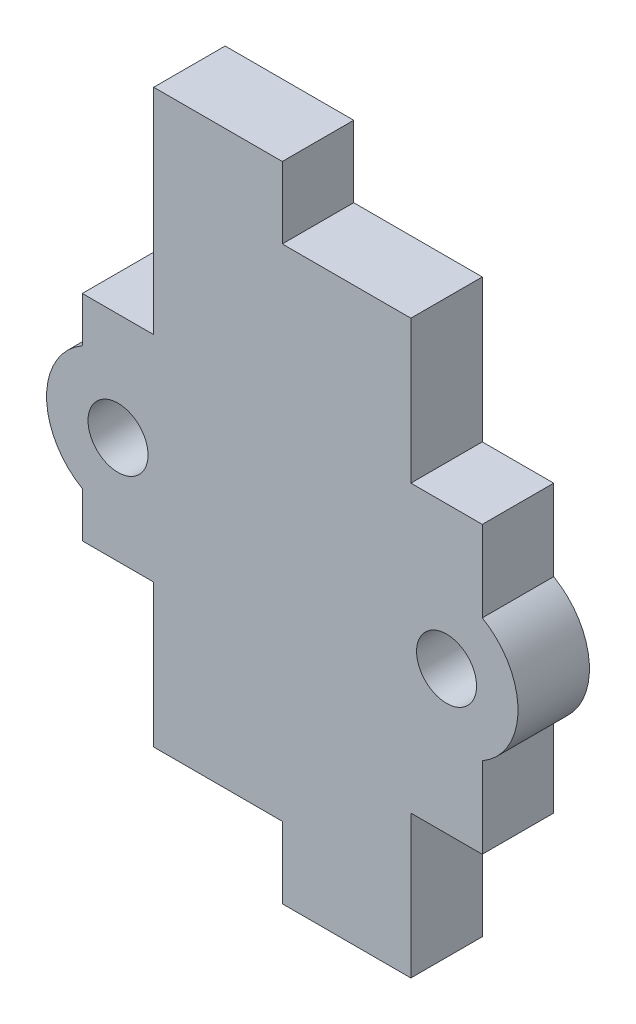
ISO-10303-21;
HEADER;
FILE_DESCRIPTION(('STEP AP214'),'2;1');
FILE_NAME('part.step','',(''),(''),'','','');
FILE_SCHEMA(('AUTOMOTIVE_DESIGN { 1 0 10303 214 1 1 1 1 }'));
ENDSEC;
DATA;
#1=APPLICATION_CONTEXT('core data for automotive mechanical design processes');
#2=APPLICATION_PROTOCOL_DEFINITION('international standard','automotive_design',2000,#1);
#3=PRODUCT_CONTEXT('',#1,'mechanical');
#4=PRODUCT('Part','Part','',(#3));
#5=PRODUCT_RELATED_PRODUCT_CATEGORY('part','',(#4));
#6=PRODUCT_DEFINITION_FORMATION('','',#4);
#7=PRODUCT_DEFINITION_CONTEXT('part definition',#1,'design');
#8=PRODUCT_DEFINITION('design','',#6,#7);
#9=PRODUCT_DEFINITION_SHAPE('','',#8);
#10=(LENGTH_UNIT() NAMED_UNIT(*) SI_UNIT(.MILLI.,.METRE.));
#11=(NAMED_UNIT(*) PLANE_ANGLE_UNIT() SI_UNIT($,.RADIAN.));
#12=(NAMED_UNIT(*) SI_UNIT($,.STERADIAN.) SOLID_ANGLE_UNIT());
#13=UNCERTAINTY_MEASURE_WITH_UNIT(LENGTH_MEASURE(1.E-05),#10,'distance_accuracy_value','');
#14=(GEOMETRIC_REPRESENTATION_CONTEXT(3) GLOBAL_UNCERTAINTY_ASSIGNED_CONTEXT((#13)) GLOBAL_UNIT_ASSIGNED_CONTEXT((#10,
#11,#12)) REPRESENTATION_CONTEXT('',''));
#15=CARTESIAN_POINT('',(0.,0.,0.));
#16=DIRECTION('',(0.,0.,1.));
#17=DIRECTION('',(1.,0.,0.));
#18=AXIS2_PLACEMENT_3D('',#15,#16,#17);
#19=CARTESIAN_POINT('',(-23.,10.,0.));
#20=DIRECTION('',(-1.,0.,0.));
#21=DIRECTION('',(0.,0.,1.));
#22=AXIS2_PLACEMENT_3D('',#19,#20,#21);
#23=PLANE('',#22);
#24=DIRECTION('',(0.,-1.,0.));
#25=VECTOR('',#24,1.);
#26=CARTESIAN_POINT('',(-23.,10.,5.));
#27=LINE('',#26,#25);
#28=CARTESIAN_POINT('',(-23.,13.1698729810778,5.));
#29=VERTEX_POINT('',#28);
#30=CARTESIAN_POINT('',(-23.,10.,5.));
#31=VERTEX_POINT('',#30);
#32=EDGE_CURVE('E188',#29,#31,#27,.T.);
#33=ORIENTED_EDGE('',*,*,#32,.F.);
#34=DIRECTION('',(0.,0.,1.));
#35=VECTOR('',#34,1.);
#36=CARTESIAN_POINT('',(-23.,13.1698729810778,0.));
#37=LINE('',#36,#35);
#38=CARTESIAN_POINT('',(-23.,13.1698729810778,0.));
#39=VERTEX_POINT('',#38);
#40=EDGE_CURVE('E175',#39,#29,#37,.T.);
#41=ORIENTED_EDGE('',*,*,#40,.F.);
#42=DIRECTION('',(0.,-1.,0.));
#43=VECTOR('',#42,1.);
#44=CARTESIAN_POINT('',(-23.,10.,0.));
#45=LINE('',#44,#43);
#46=CARTESIAN_POINT('',(-23.,10.,0.));
#47=VERTEX_POINT('',#46);
#48=EDGE_CURVE('E186',#39,#47,#45,.T.);
#49=ORIENTED_EDGE('',*,*,#48,.T.);
#50=DIRECTION('',(0.,0.,1.));
#51=VECTOR('',#50,1.);
#52=CARTESIAN_POINT('',(-23.,10.,0.));
#53=LINE('',#52,#51);
#54=EDGE_CURVE('E215',#47,#31,#53,.T.);
#55=ORIENTED_EDGE('',*,*,#54,.T.);
#56=EDGE_LOOP('',(#33,#41,#49,#55));
#57=FACE_BOUND('',#56,.T.);
#58=ADVANCED_FACE('F36',(#57),#23,.T.);
#59=CARTESIAN_POINT('',(-23.,25.,0.));
#60=VERTEX_POINT('',#59);
#61=CARTESIAN_POINT('',(-23.,21.8301270189222,0.));
#62=VERTEX_POINT('',#61);
#63=EDGE_CURVE('E194',#60,#62,#45,.T.);
#64=ORIENTED_EDGE('',*,*,#63,.T.);
#65=DIRECTION('',(0.,0.,1.));
#66=VECTOR('',#65,1.);
#67=CARTESIAN_POINT('',(-23.,21.8301270189222,0.));
#68=LINE('',#67,#66);
#69=CARTESIAN_POINT('',(-23.,21.8301270189222,5.));
#70=VERTEX_POINT('',#69);
#71=EDGE_CURVE('E178',#62,#70,#68,.T.);
#72=ORIENTED_EDGE('',*,*,#71,.T.);
#73=CARTESIAN_POINT('',(-23.,25.,5.));
#74=VERTEX_POINT('',#73);
#75=EDGE_CURVE('E208',#74,#70,#27,.T.);
#76=ORIENTED_EDGE('',*,*,#75,.F.);
#77=DIRECTION('',(0.,0.,1.));
#78=VECTOR('',#77,1.);
#79=CARTESIAN_POINT('',(-23.,25.,0.));
#80=LINE('',#79,#78);
#81=EDGE_CURVE('E217',#60,#74,#80,.T.);
#82=ORIENTED_EDGE('',*,*,#81,.F.);
#83=EDGE_LOOP('',(#64,#72,#76,#82));
#84=FACE_BOUND('',#83,.T.);
#85=ADVANCED_FACE('F327',(#84),#23,.T.);
#86=CARTESIAN_POINT('',(5.,0.,0.));
#87=DIRECTION('',(-1.,0.,0.));
#88=DIRECTION('',(0.,0.,1.));
#89=AXIS2_PLACEMENT_3D('',#86,#87,#88);
#90=PLANE('',#89);
#91=DIRECTION('',(0.,-1.,0.));
#92=VECTOR('',#91,1.);
#93=CARTESIAN_POINT('',(5.,5.0000000000001,5.));
#94=LINE('',#93,#92);
#95=CARTESIAN_POINT('',(5.,25.0000000000001,5.));
#96=VERTEX_POINT('',#95);
#97=CARTESIAN_POINT('',(5.,19.3301270189223,5.));
#98=VERTEX_POINT('',#97);
#99=EDGE_CURVE('E240',#96,#98,#94,.T.);
#100=ORIENTED_EDGE('',*,*,#99,.T.);
#101=DIRECTION('',(0.,0.,-1.));
#102=VECTOR('',#101,1.);
#103=CARTESIAN_POINT('',(5.,19.3301270189223,5.));
#104=LINE('',#103,#102);
#105=CARTESIAN_POINT('',(5.,19.3301270189223,0.));
#106=VERTEX_POINT('',#105);
#107=EDGE_CURVE('E397',#98,#106,#104,.T.);
#108=ORIENTED_EDGE('',*,*,#107,.T.);
#109=DIRECTION('',(0.,1.,0.));
#110=VECTOR('',#109,1.);
#111=CARTESIAN_POINT('',(5.,5.0000000000001,0.));
#112=LINE('',#111,#110);
#113=CARTESIAN_POINT('',(5.,25.0000000000001,0.));
#114=VERTEX_POINT('',#113);
#115=EDGE_CURVE('E245',#106,#114,#112,.T.);
#116=ORIENTED_EDGE('',*,*,#115,.T.);
#117=DIRECTION('',(0.,0.,1.));
#118=VECTOR('',#117,1.);
#119=CARTESIAN_POINT('',(5.,25.0000000000001,5.));
#120=LINE('',#119,#118);
#121=EDGE_CURVE('E247',#114,#96,#120,.T.);
#122=ORIENTED_EDGE('',*,*,#121,.T.);
#123=EDGE_LOOP('',(#100,#108,#116,#122));
#124=FACE_BOUND('',#123,.T.);
#125=ADVANCED_FACE('F331',(#124),#90,.F.);
#126=CARTESIAN_POINT('',(0.,35.,5.));
#127=DIRECTION('',(0.,-1.,0.));
#128=DIRECTION('',(0.,0.,-1.));
#129=AXIS2_PLACEMENT_3D('',#126,#127,#128);
#130=PLANE('',#129);
#131=DIRECTION('',(0.,0.,-1.));
#132=VECTOR('',#131,1.);
#133=CARTESIAN_POINT('',(-9.,35.,0.));
#134=LINE('',#133,#132);
#135=CARTESIAN_POINT('',(-9.,35.,5.));
#136=VERTEX_POINT('',#135);
#137=CARTESIAN_POINT('',(-9.,35.,0.));
#138=VERTEX_POINT('',#137);
#139=EDGE_CURVE('E369',#136,#138,#134,.T.);
#140=ORIENTED_EDGE('',*,*,#139,.F.);
#141=DIRECTION('',(-1.,0.,0.));
#142=VECTOR('',#141,1.);
#143=CARTESIAN_POINT('',(0.,35.,5.));
#144=LINE('',#143,#142);
#145=CARTESIAN_POINT('',(0.,35.,5.));
#146=VERTEX_POINT('',#145);
#147=EDGE_CURVE('E270',#146,#136,#144,.T.);
#148=ORIENTED_EDGE('',*,*,#147,.F.);
#149=DIRECTION('',(0.,0.,-1.));
#150=VECTOR('',#149,1.);
#151=CARTESIAN_POINT('',(0.,35.,5.));
#152=LINE('',#151,#150);
#153=CARTESIAN_POINT('',(0.,35.,0.));
#154=VERTEX_POINT('',#153);
#155=EDGE_CURVE('E11',#146,#154,#152,.T.);
#156=ORIENTED_EDGE('',*,*,#155,.T.);
#157=DIRECTION('',(-1.,0.,0.));
#158=VECTOR('',#157,1.);
#159=CARTESIAN_POINT('',(0.,35.,0.));
#160=LINE('',#159,#158);
#161=EDGE_CURVE('E283',#154,#138,#160,.T.);
#162=ORIENTED_EDGE('',*,*,#161,.T.);
#163=EDGE_LOOP('',(#140,#148,#156,#162));
#164=FACE_BOUND('',#163,.T.);
#165=ADVANCED_FACE('F359',(#164),#130,.F.);
#166=CARTESIAN_POINT('',(-18.,0.,5.));
#167=DIRECTION('',(1.,0.,0.));
#168=DIRECTION('',(0.,0.,-1.));
#169=AXIS2_PLACEMENT_3D('',#166,#167,#168);
#170=PLANE('',#169);
#171=DIRECTION('',(0.,0.,1.));
#172=VECTOR('',#171,1.);
#173=CARTESIAN_POINT('',(-18.,10.,0.));
#174=LINE('',#173,#172);
#175=CARTESIAN_POINT('',(-18.,10.,0.));
#176=VERTEX_POINT('',#175);
#177=CARTESIAN_POINT('',(-18.,10.,5.));
#178=VERTEX_POINT('',#177);
#179=EDGE_CURVE('E212',#176,#178,#174,.T.);
#180=ORIENTED_EDGE('',*,*,#179,.F.);
#181=DIRECTION('',(0.,-1.,0.));
#182=VECTOR('',#181,1.);
#183=CARTESIAN_POINT('',(-18.,0.,0.));
#184=LINE('',#183,#182);
#185=CARTESIAN_POINT('',(-18.,0.,0.));
#186=VERTEX_POINT('',#185);
#187=EDGE_CURVE('E285',#176,#186,#184,.T.);
#188=ORIENTED_EDGE('',*,*,#187,.T.);
#189=DIRECTION('',(0.,0.,-1.));
#190=VECTOR('',#189,1.);
#191=CARTESIAN_POINT('',(-18.,0.,5.));
#192=LINE('',#191,#190);
#193=CARTESIAN_POINT('',(-18.,0.,5.));
#194=VERTEX_POINT('',#193);
#195=EDGE_CURVE('E44',#194,#186,#192,.T.);
#196=ORIENTED_EDGE('',*,*,#195,.F.);
#197=DIRECTION('',(0.,-1.,0.));
#198=VECTOR('',#197,1.);
#199=CARTESIAN_POINT('',(-18.,0.,5.));
#200=LINE('',#199,#198);
#201=EDGE_CURVE('E274',#178,#194,#200,.T.);
#202=ORIENTED_EDGE('',*,*,#201,.F.);
#203=EDGE_LOOP('',(#180,#188,#196,#202));
#204=FACE_BOUND('',#203,.T.);
#205=ADVANCED_FACE('F308',(#204),#170,.F.);
#206=CARTESIAN_POINT('',(0.,0.,5.));
#207=DIRECTION('',(0.,1.,0.));
#208=DIRECTION('',(0.,0.,1.));
#209=AXIS2_PLACEMENT_3D('',#206,#207,#208);
#210=PLANE('',#209);
#211=DIRECTION('',(0.,0.,-1.));
#212=VECTOR('',#211,1.);
#213=CARTESIAN_POINT('',(-9.,0.,5.));
#214=LINE('',#213,#212);
#215=CARTESIAN_POINT('',(-9.,0.,5.));
#216=VERTEX_POINT('',#215);
#217=CARTESIAN_POINT('',(-9.,0.,0.));
#218=VERTEX_POINT('',#217);
#219=EDGE_CURVE('E214',#216,#218,#214,.T.);
#220=ORIENTED_EDGE('',*,*,#219,.F.);
#221=DIRECTION('',(1.,0.,0.));
#222=VECTOR('',#221,1.);
#223=CARTESIAN_POINT('',(0.,0.,5.));
#224=LINE('',#223,#222);
#225=EDGE_CURVE('E278',#194,#216,#224,.T.);
#226=ORIENTED_EDGE('',*,*,#225,.F.);
#227=ORIENTED_EDGE('',*,*,#195,.T.);
#228=DIRECTION('',(1.,0.,0.));
#229=VECTOR('',#228,1.);
#230=CARTESIAN_POINT('',(0.,0.,0.));
#231=LINE('',#230,#229);
#232=EDGE_CURVE('E289',#186,#218,#231,.T.);
#233=ORIENTED_EDGE('',*,*,#232,.T.);
#234=EDGE_LOOP('',(#220,#226,#227,#233));
#235=FACE_BOUND('',#234,.T.);
#236=ADVANCED_FACE('F295',(#235),#210,.F.);
#237=CARTESIAN_POINT('',(0.,0.,5.));
#238=DIRECTION('',(-1.,0.,0.));
#239=DIRECTION('',(0.,0.,1.));
#240=AXIS2_PLACEMENT_3D('',#237,#238,#239);
#241=PLANE('',#240);
#242=DIRECTION('',(0.,0.,1.));
#243=VECTOR('',#242,1.);
#244=CARTESIAN_POINT('',(0.,25.0000000000001,5.));
#245=LINE('',#244,#243);
#246=CARTESIAN_POINT('',(0.,25.0000000000001,0.));
#247=VERTEX_POINT('',#246);
#248=CARTESIAN_POINT('',(0.,25.0000000000001,5.));
#249=VERTEX_POINT('',#248);
#250=EDGE_CURVE('E252',#247,#249,#245,.T.);
#251=ORIENTED_EDGE('',*,*,#250,.F.);
#252=DIRECTION('',(0.,1.,0.));
#253=VECTOR('',#252,1.);
#254=CARTESIAN_POINT('',(0.,0.,0.));
#255=LINE('',#254,#253);
#256=EDGE_CURVE('E266',#247,#154,#255,.T.);
#257=ORIENTED_EDGE('',*,*,#256,.T.);
#258=ORIENTED_EDGE('',*,*,#155,.F.);
#259=DIRECTION('',(0.,1.,0.));
#260=VECTOR('',#259,1.);
#261=CARTESIAN_POINT('',(0.,0.,5.));
#262=LINE('',#261,#260);
#263=EDGE_CURVE('E271',#249,#146,#262,.T.);
#264=ORIENTED_EDGE('',*,*,#263,.F.);
#265=EDGE_LOOP('',(#251,#257,#258,#264));
#266=FACE_BOUND('',#265,.T.);
#267=ADVANCED_FACE('F38',(#266),#241,.F.);
#268=DIRECTION('',(0.,0.,-1.));
#269=VECTOR('',#268,1.);
#270=CARTESIAN_POINT('',(0.,5.0000000000001,5.));
#271=LINE('',#270,#269);
#272=CARTESIAN_POINT('',(0.,5.0000000000001,5.));
#273=VERTEX_POINT('',#272);
#274=CARTESIAN_POINT('',(0.,5.0000000000001,0.));
#275=VERTEX_POINT('',#274);
#276=EDGE_CURVE('E239',#273,#275,#271,.T.);
#277=ORIENTED_EDGE('',*,*,#276,.F.);
#278=CARTESIAN_POINT('',(0.,-5.,5.));
#279=VERTEX_POINT('',#278);
#280=EDGE_CURVE('E267',#279,#273,#262,.T.);
#281=ORIENTED_EDGE('',*,*,#280,.F.);
#282=DIRECTION('',(0.,0.,1.));
#283=VECTOR('',#282,1.);
#284=CARTESIAN_POINT('',(0.,-5.,5.));
#285=LINE('',#284,#283);
#286=CARTESIAN_POINT('',(0.,-5.,0.));
#287=VERTEX_POINT('',#286);
#288=EDGE_CURVE('E221',#287,#279,#285,.T.);
#289=ORIENTED_EDGE('',*,*,#288,.F.);
#290=EDGE_CURVE('E281',#287,#275,#255,.T.);
#291=ORIENTED_EDGE('',*,*,#290,.T.);
#292=EDGE_LOOP('',(#277,#281,#289,#291));
#293=FACE_BOUND('',#292,.T.);
#294=ADVANCED_FACE('F357',(#293),#241,.F.);
#295=CARTESIAN_POINT('',(-18.,40.,0.));
#296=VERTEX_POINT('',#295);
#297=CARTESIAN_POINT('',(-18.,25.,0.));
#298=VERTEX_POINT('',#297);
#299=EDGE_CURVE('E286',#296,#298,#184,.T.);
#300=ORIENTED_EDGE('',*,*,#299,.T.);
#301=DIRECTION('',(0.,0.,1.));
#302=VECTOR('',#301,1.);
#303=CARTESIAN_POINT('',(-18.,25.,0.));
#304=LINE('',#303,#302);
#305=CARTESIAN_POINT('',(-18.,25.,5.));
#306=VERTEX_POINT('',#305);
#307=EDGE_CURVE('E203',#298,#306,#304,.T.);
#308=ORIENTED_EDGE('',*,*,#307,.T.);
#309=CARTESIAN_POINT('',(-18.,40.,5.));
#310=VERTEX_POINT('',#309);
#311=EDGE_CURVE('E275',#310,#306,#200,.T.);
#312=ORIENTED_EDGE('',*,*,#311,.F.);
#313=DIRECTION('',(0.,0.,1.));
#314=VECTOR('',#313,1.);
#315=CARTESIAN_POINT('',(-18.,40.,0.));
#316=LINE('',#315,#314);
#317=EDGE_CURVE('E376',#296,#310,#316,.T.);
#318=ORIENTED_EDGE('',*,*,#317,.F.);
#319=EDGE_LOOP('',(#300,#308,#312,#318));
#320=FACE_BOUND('',#319,.T.);
#321=ADVANCED_FACE('F349',(#320),#170,.F.);
#322=CARTESIAN_POINT('',(0.,0.,5.));
#323=DIRECTION('',(0.,0.,1.));
#324=DIRECTION('',(1.,0.,0.));
#325=AXIS2_PLACEMENT_3D('',#322,#323,#324);
#326=PLANE('',#325);
#327=CARTESIAN_POINT('',(-20.5,17.5,5.));
#328=DIRECTION('',(0.,0.,1.));
#329=DIRECTION('',(1.,0.,0.));
#330=AXIS2_PLACEMENT_3D('',#327,#328,#329);
#331=CIRCLE('',#330,2.1);
#332=CARTESIAN_POINT('',(-18.4,17.5,5.));
#333=VERTEX_POINT('',#332);
#334=EDGE_CURVE('E411',#333,#333,#331,.T.);
#335=ORIENTED_EDGE('',*,*,#334,.F.);
#336=EDGE_LOOP('',(#335));
#337=FACE_BOUND('',#336,.T.);
#338=CARTESIAN_POINT('',(2.5,15.0000000000001,5.));
#339=DIRECTION('',(0.,0.,-1.));
#340=DIRECTION('',(-1.,0.,0.));
#341=AXIS2_PLACEMENT_3D('',#338,#339,#340);
#342=CIRCLE('',#341,2.1);
#343=CARTESIAN_POINT('',(0.400000000000001,15.0000000000001,5.));
#344=VERTEX_POINT('',#343);
#345=EDGE_CURVE('E377',#344,#344,#342,.T.);
#346=ORIENTED_EDGE('',*,*,#345,.T.);
#347=EDGE_LOOP('',(#346));
#348=FACE_BOUND('',#347,.T.);
#349=ORIENTED_EDGE('',*,*,#280,.T.);
#350=DIRECTION('',(-1.,0.,0.));
#351=VECTOR('',#350,1.);
#352=CARTESIAN_POINT('',(5.,5.0000000000001,5.));
#353=LINE('',#352,#351);
#354=CARTESIAN_POINT('',(5.,5.0000000000001,5.));
#355=VERTEX_POINT('',#354);
#356=EDGE_CURVE('E263',#355,#273,#353,.T.);
#357=ORIENTED_EDGE('',*,*,#356,.F.);
#358=CARTESIAN_POINT('',(5.,10.6698729810779,5.));
#359=VERTEX_POINT('',#358);
#360=EDGE_CURVE('E243',#359,#355,#94,.T.);
#361=ORIENTED_EDGE('',*,*,#360,.F.);
#362=CARTESIAN_POINT('',(2.5,15.0000000000001,5.));
#363=DIRECTION('',(0.,0.,-1.));
#364=DIRECTION('',(1.,0.,0.));
#365=AXIS2_PLACEMENT_3D('',#362,#363,#364);
#366=CIRCLE('',#365,5.);
#367=EDGE_CURVE('E402',#98,#359,#366,.T.);
#368=ORIENTED_EDGE('',*,*,#367,.F.);
#369=ORIENTED_EDGE('',*,*,#99,.F.);
#370=DIRECTION('',(-1.,0.,0.));
#371=VECTOR('',#370,1.);
#372=CARTESIAN_POINT('',(5.,25.0000000000001,5.));
#373=LINE('',#372,#371);
#374=EDGE_CURVE('E249',#96,#249,#373,.T.);
#375=ORIENTED_EDGE('',*,*,#374,.T.);
#376=ORIENTED_EDGE('',*,*,#263,.T.);
#377=ORIENTED_EDGE('',*,*,#147,.T.);
#378=DIRECTION('',(0.,-1.,0.));
#379=VECTOR('',#378,1.);
#380=CARTESIAN_POINT('',(-9.,40.,5.));
#381=LINE('',#380,#379);
#382=CARTESIAN_POINT('',(-9.,40.,5.));
#383=VERTEX_POINT('',#382);
#384=EDGE_CURVE('E207',#383,#136,#381,.T.);
#385=ORIENTED_EDGE('',*,*,#384,.F.);
#386=DIRECTION('',(1.,0.,0.));
#387=VECTOR('',#386,1.);
#388=CARTESIAN_POINT('',(-18.,40.,5.));
#389=LINE('',#388,#387);
#390=EDGE_CURVE('E390',#310,#383,#389,.T.);
#391=ORIENTED_EDGE('',*,*,#390,.F.);
#392=ORIENTED_EDGE('',*,*,#311,.T.);
#393=DIRECTION('',(-1.,0.,0.));
#394=VECTOR('',#393,1.);
#395=CARTESIAN_POINT('',(-18.,25.,5.));
#396=LINE('',#395,#394);
#397=EDGE_CURVE('E204',#306,#74,#396,.T.);
#398=ORIENTED_EDGE('',*,*,#397,.T.);
#399=ORIENTED_EDGE('',*,*,#75,.T.);
#400=CARTESIAN_POINT('',(-20.5,17.5,5.));
#401=DIRECTION('',(0.,0.,1.));
#402=DIRECTION('',(1.,0.,0.));
#403=AXIS2_PLACEMENT_3D('',#400,#401,#402);
#404=CIRCLE('',#403,5.);
#405=EDGE_CURVE('E51',#29,#70,#404,.F.);
#406=ORIENTED_EDGE('',*,*,#405,.F.);
#407=ORIENTED_EDGE('',*,*,#32,.T.);
#408=DIRECTION('',(1.,0.,0.));
#409=VECTOR('',#408,1.);
#410=CARTESIAN_POINT('',(-18.,10.,5.));
#411=LINE('',#410,#409);
#412=EDGE_CURVE('E198',#31,#178,#411,.T.);
#413=ORIENTED_EDGE('',*,*,#412,.T.);
#414=ORIENTED_EDGE('',*,*,#201,.T.);
#415=ORIENTED_EDGE('',*,*,#225,.T.);
#416=DIRECTION('',(0.,1.,0.));
#417=VECTOR('',#416,1.);
#418=CARTESIAN_POINT('',(-9.,-5.,5.));
#419=LINE('',#418,#417);
#420=CARTESIAN_POINT('',(-9.,-5.,5.));
#421=VERTEX_POINT('',#420);
#422=EDGE_CURVE('E236',#421,#216,#419,.T.);
#423=ORIENTED_EDGE('',*,*,#422,.F.);
#424=DIRECTION('',(-1.,0.,0.));
#425=VECTOR('',#424,1.);
#426=CARTESIAN_POINT('',(0.,-5.,5.));
#427=LINE('',#426,#425);
#428=EDGE_CURVE('E224',#279,#421,#427,.T.);
#429=ORIENTED_EDGE('',*,*,#428,.F.);
#430=EDGE_LOOP('',(#349,#357,#361,#368,#369,#375,#376,#377,#385,#391,#392,#398,#399,#406,#407,
#413,#414,#415,#423,#429));
#431=FACE_BOUND('',#430,.T.);
#432=ADVANCED_FACE('F304',(#337,#348,#431),#326,.T.);
#433=CARTESIAN_POINT('',(0.,0.,0.));
#434=DIRECTION('',(0.,0.,1.));
#435=DIRECTION('',(1.,0.,0.));
#436=AXIS2_PLACEMENT_3D('',#433,#434,#435);
#437=PLANE('',#436);
#438=CARTESIAN_POINT('',(-20.5,17.5,0.));
#439=DIRECTION('',(0.,0.,1.));
#440=DIRECTION('',(1.,0.,0.));
#441=AXIS2_PLACEMENT_3D('',#438,#439,#440);
#442=CIRCLE('',#441,2.1);
#443=CARTESIAN_POINT('',(-18.4,17.5,0.));
#444=VERTEX_POINT('',#443);
#445=EDGE_CURVE('E408',#444,#444,#442,.T.);
#446=ORIENTED_EDGE('',*,*,#445,.T.);
#447=EDGE_LOOP('',(#446));
#448=FACE_BOUND('',#447,.T.);
#449=CARTESIAN_POINT('',(2.5,15.0000000000001,0.));
#450=DIRECTION('',(0.,0.,-1.));
#451=DIRECTION('',(-1.,0.,0.));
#452=AXIS2_PLACEMENT_3D('',#449,#450,#451);
#453=CIRCLE('',#452,2.1);
#454=CARTESIAN_POINT('',(0.400000000000001,15.0000000000001,0.));
#455=VERTEX_POINT('',#454);
#456=EDGE_CURVE('E394',#455,#455,#453,.T.);
#457=ORIENTED_EDGE('',*,*,#456,.F.);
#458=EDGE_LOOP('',(#457));
#459=FACE_BOUND('',#458,.T.);
#460=ORIENTED_EDGE('',*,*,#290,.F.);
#461=DIRECTION('',(1.,0.,0.));
#462=VECTOR('',#461,1.);
#463=CARTESIAN_POINT('',(0.,-5.,0.));
#464=LINE('',#463,#462);
#465=CARTESIAN_POINT('',(-9.,-5.,0.));
#466=VERTEX_POINT('',#465);
#467=EDGE_CURVE('E228',#466,#287,#464,.T.);
#468=ORIENTED_EDGE('',*,*,#467,.F.);
#469=DIRECTION('',(0.,1.,0.));
#470=VECTOR('',#469,1.);
#471=CARTESIAN_POINT('',(-9.,-5.,0.));
#472=LINE('',#471,#470);
#473=EDGE_CURVE('E231',#466,#218,#472,.T.);
#474=ORIENTED_EDGE('',*,*,#473,.T.);
#475=ORIENTED_EDGE('',*,*,#232,.F.);
#476=ORIENTED_EDGE('',*,*,#187,.F.);
#477=DIRECTION('',(1.,0.,0.));
#478=VECTOR('',#477,1.);
#479=CARTESIAN_POINT('',(-18.,10.,0.));
#480=LINE('',#479,#478);
#481=EDGE_CURVE('E193',#47,#176,#480,.T.);
#482=ORIENTED_EDGE('',*,*,#481,.F.);
#483=ORIENTED_EDGE('',*,*,#48,.F.);
#484=CARTESIAN_POINT('',(-20.5,17.5,0.));
#485=DIRECTION('',(0.,0.,1.));
#486=DIRECTION('',(1.,0.,0.));
#487=AXIS2_PLACEMENT_3D('',#484,#485,#486);
#488=CIRCLE('',#487,5.);
#489=EDGE_CURVE('E172',#39,#62,#488,.F.);
#490=ORIENTED_EDGE('',*,*,#489,.T.);
#491=ORIENTED_EDGE('',*,*,#63,.F.);
#492=DIRECTION('',(-1.,0.,0.));
#493=VECTOR('',#492,1.);
#494=CARTESIAN_POINT('',(-18.,25.,0.));
#495=LINE('',#494,#493);
#496=EDGE_CURVE('E195',#298,#60,#495,.T.);
#497=ORIENTED_EDGE('',*,*,#496,.F.);
#498=ORIENTED_EDGE('',*,*,#299,.F.);
#499=DIRECTION('',(-1.,0.,0.));
#500=VECTOR('',#499,1.);
#501=CARTESIAN_POINT('',(-18.,40.,0.));
#502=LINE('',#501,#500);
#503=CARTESIAN_POINT('',(-9.,40.,0.));
#504=VERTEX_POINT('',#503);
#505=EDGE_CURVE('E384',#504,#296,#502,.T.);
#506=ORIENTED_EDGE('',*,*,#505,.F.);
#507=DIRECTION('',(0.,-1.,0.));
#508=VECTOR('',#507,1.);
#509=CARTESIAN_POINT('',(-9.,40.,0.));
#510=LINE('',#509,#508);
#511=EDGE_CURVE('E383',#504,#138,#510,.T.);
#512=ORIENTED_EDGE('',*,*,#511,.T.);
#513=ORIENTED_EDGE('',*,*,#161,.F.);
#514=ORIENTED_EDGE('',*,*,#256,.F.);
#515=DIRECTION('',(-1.,0.,0.));
#516=VECTOR('',#515,1.);
#517=CARTESIAN_POINT('',(5.,25.0000000000001,0.));
#518=LINE('',#517,#516);
#519=EDGE_CURVE('E257',#114,#247,#518,.T.);
#520=ORIENTED_EDGE('',*,*,#519,.F.);
#521=ORIENTED_EDGE('',*,*,#115,.F.);
#522=CARTESIAN_POINT('',(2.5,15.0000000000001,0.));
#523=DIRECTION('',(0.,0.,-1.));
#524=DIRECTION('',(1.,0.,0.));
#525=AXIS2_PLACEMENT_3D('',#522,#523,#524);
#526=CIRCLE('',#525,5.);
#527=CARTESIAN_POINT('',(5.,10.6698729810779,0.));
#528=VERTEX_POINT('',#527);
#529=EDGE_CURVE('E405',#106,#528,#526,.T.);
#530=ORIENTED_EDGE('',*,*,#529,.T.);
#531=CARTESIAN_POINT('',(5.,5.0000000000001,0.));
#532=VERTEX_POINT('',#531);
#533=EDGE_CURVE('E59',#532,#528,#112,.T.);
#534=ORIENTED_EDGE('',*,*,#533,.F.);
#535=DIRECTION('',(-1.,0.,0.));
#536=VECTOR('',#535,1.);
#537=CARTESIAN_POINT('',(5.,5.0000000000001,0.));
#538=LINE('',#537,#536);
#539=EDGE_CURVE('E260',#532,#275,#538,.T.);
#540=ORIENTED_EDGE('',*,*,#539,.T.);
#541=EDGE_LOOP('',(#460,#468,#474,#475,#476,#482,#483,#490,#491,#497,#498,#506,#512,#513,#514,
#520,#521,#530,#534,#540));
#542=FACE_BOUND('',#541,.T.);
#543=ADVANCED_FACE('F191',(#448,#459,#542),#437,.F.);
#544=CARTESIAN_POINT('',(5.,5.0000000000001,5.));
#545=DIRECTION('',(0.,1.,0.));
#546=DIRECTION('',(0.,0.,1.));
#547=AXIS2_PLACEMENT_3D('',#544,#545,#546);
#548=PLANE('',#547);
#549=ORIENTED_EDGE('',*,*,#276,.T.);
#550=ORIENTED_EDGE('',*,*,#539,.F.);
#551=DIRECTION('',(0.,0.,-1.));
#552=VECTOR('',#551,1.);
#553=CARTESIAN_POINT('',(5.,5.0000000000001,5.));
#554=LINE('',#553,#552);
#555=EDGE_CURVE('E242',#355,#532,#554,.T.);
#556=ORIENTED_EDGE('',*,*,#555,.F.);
#557=ORIENTED_EDGE('',*,*,#356,.T.);
#558=EDGE_LOOP('',(#549,#550,#556,#557));
#559=FACE_BOUND('',#558,.T.);
#560=ADVANCED_FACE('F342',(#559),#548,.F.);
#561=CARTESIAN_POINT('',(5.,25.0000000000001,5.));
#562=DIRECTION('',(0.,-1.,0.));
#563=DIRECTION('',(0.,0.,-1.));
#564=AXIS2_PLACEMENT_3D('',#561,#562,#563);
#565=PLANE('',#564);
#566=ORIENTED_EDGE('',*,*,#250,.T.);
#567=ORIENTED_EDGE('',*,*,#374,.F.);
#568=ORIENTED_EDGE('',*,*,#121,.F.);
#569=ORIENTED_EDGE('',*,*,#519,.T.);
#570=EDGE_LOOP('',(#566,#567,#568,#569));
#571=FACE_BOUND('',#570,.T.);
#572=ADVANCED_FACE('F339',(#571),#565,.F.);
#573=ORIENTED_EDGE('',*,*,#533,.T.);
#574=DIRECTION('',(0.,0.,-1.));
#575=VECTOR('',#574,1.);
#576=CARTESIAN_POINT('',(5.,10.6698729810779,5.));
#577=LINE('',#576,#575);
#578=EDGE_CURVE('E400',#359,#528,#577,.T.);
#579=ORIENTED_EDGE('',*,*,#578,.F.);
#580=ORIENTED_EDGE('',*,*,#360,.T.);
#581=ORIENTED_EDGE('',*,*,#555,.T.);
#582=EDGE_LOOP('',(#573,#579,#580,#581));
#583=FACE_BOUND('',#582,.T.);
#584=ADVANCED_FACE('F336',(#583),#90,.F.);
#585=CARTESIAN_POINT('',(-9.,-5.,5.));
#586=DIRECTION('',(1.,0.,0.));
#587=DIRECTION('',(0.,0.,-1.));
#588=AXIS2_PLACEMENT_3D('',#585,#586,#587);
#589=PLANE('',#588);
#590=ORIENTED_EDGE('',*,*,#219,.T.);
#591=ORIENTED_EDGE('',*,*,#473,.F.);
#592=DIRECTION('',(0.,0.,-1.));
#593=VECTOR('',#592,1.);
#594=CARTESIAN_POINT('',(-9.,-5.,5.));
#595=LINE('',#594,#593);
#596=EDGE_CURVE('E226',#421,#466,#595,.T.);
#597=ORIENTED_EDGE('',*,*,#596,.F.);
#598=ORIENTED_EDGE('',*,*,#422,.T.);
#599=EDGE_LOOP('',(#590,#591,#597,#598));
#600=FACE_BOUND('',#599,.T.);
#601=ADVANCED_FACE('F302',(#600),#589,.F.);
#602=CARTESIAN_POINT('',(0.,-5.,0.));
#603=DIRECTION('',(0.,1.,0.));
#604=DIRECTION('',(0.,0.,1.));
#605=AXIS2_PLACEMENT_3D('',#602,#603,#604);
#606=PLANE('',#605);
#607=ORIENTED_EDGE('',*,*,#288,.T.);
#608=ORIENTED_EDGE('',*,*,#428,.T.);
#609=ORIENTED_EDGE('',*,*,#596,.T.);
#610=ORIENTED_EDGE('',*,*,#467,.T.);
#611=EDGE_LOOP('',(#607,#608,#609,#610));
#612=FACE_BOUND('',#611,.T.);
#613=ADVANCED_FACE('F313',(#612),#606,.F.);
#614=CARTESIAN_POINT('',(-18.,10.,0.));
#615=DIRECTION('',(0.,-1.,0.));
#616=DIRECTION('',(0.,0.,-1.));
#617=AXIS2_PLACEMENT_3D('',#614,#615,#616);
#618=PLANE('',#617);
#619=ORIENTED_EDGE('',*,*,#412,.F.);
#620=ORIENTED_EDGE('',*,*,#54,.F.);
#621=ORIENTED_EDGE('',*,*,#481,.T.);
#622=ORIENTED_EDGE('',*,*,#179,.T.);
#623=EDGE_LOOP('',(#619,#620,#621,#622));
#624=FACE_BOUND('',#623,.T.);
#625=ADVANCED_FACE('F310',(#624),#618,.T.);
#626=CARTESIAN_POINT('',(-18.,25.,0.));
#627=DIRECTION('',(0.,1.,0.));
#628=DIRECTION('',(0.,0.,1.));
#629=AXIS2_PLACEMENT_3D('',#626,#627,#628);
#630=PLANE('',#629);
#631=ORIENTED_EDGE('',*,*,#397,.F.);
#632=ORIENTED_EDGE('',*,*,#307,.F.);
#633=ORIENTED_EDGE('',*,*,#496,.T.);
#634=ORIENTED_EDGE('',*,*,#81,.T.);
#635=EDGE_LOOP('',(#631,#632,#633,#634));
#636=FACE_BOUND('',#635,.T.);
#637=ADVANCED_FACE('F312',(#636),#630,.T.);
#638=CARTESIAN_POINT('',(-9.,40.,0.));
#639=DIRECTION('',(-1.,0.,0.));
#640=DIRECTION('',(0.,0.,1.));
#641=AXIS2_PLACEMENT_3D('',#638,#639,#640);
#642=PLANE('',#641);
#643=ORIENTED_EDGE('',*,*,#139,.T.);
#644=ORIENTED_EDGE('',*,*,#511,.F.);
#645=DIRECTION('',(0.,0.,-1.));
#646=VECTOR('',#645,1.);
#647=CARTESIAN_POINT('',(-9.,40.,0.));
#648=LINE('',#647,#646);
#649=EDGE_CURVE('E382',#383,#504,#648,.T.);
#650=ORIENTED_EDGE('',*,*,#649,.F.);
#651=ORIENTED_EDGE('',*,*,#384,.T.);
#652=EDGE_LOOP('',(#643,#644,#650,#651));
#653=FACE_BOUND('',#652,.T.);
#654=ADVANCED_FACE('F319',(#653),#642,.F.);
#655=CARTESIAN_POINT('',(0.,40.,0.));
#656=DIRECTION('',(0.,1.,0.));
#657=DIRECTION('',(0.,0.,1.));
#658=AXIS2_PLACEMENT_3D('',#655,#656,#657);
#659=PLANE('',#658);
#660=ORIENTED_EDGE('',*,*,#317,.T.);
#661=ORIENTED_EDGE('',*,*,#390,.T.);
#662=ORIENTED_EDGE('',*,*,#649,.T.);
#663=ORIENTED_EDGE('',*,*,#505,.T.);
#664=EDGE_LOOP('',(#660,#661,#662,#663));
#665=FACE_BOUND('',#664,.T.);
#666=ADVANCED_FACE('F422',(#665),#659,.T.);
#667=CARTESIAN_POINT('',(2.5,15.0000000000001,5.));
#668=DIRECTION('',(0.,0.,-1.));
#669=DIRECTION('',(-1.,0.,0.));
#670=AXIS2_PLACEMENT_3D('',#667,#668,#669);
#671=CYLINDRICAL_SURFACE('',#670,2.1);
#672=ORIENTED_EDGE('',*,*,#345,.F.);
#673=EDGE_LOOP('',(#672));
#674=FACE_BOUND('',#673,.T.);
#675=ORIENTED_EDGE('',*,*,#456,.T.);
#676=EDGE_LOOP('',(#675));
#677=FACE_BOUND('',#676,.T.);
#678=ADVANCED_FACE('F501',(#674,#677),#671,.F.);
#679=CARTESIAN_POINT('',(2.5,15.0000000000001,5.));
#680=DIRECTION('',(0.,0.,-1.));
#681=DIRECTION('',(-1.,0.,0.));
#682=AXIS2_PLACEMENT_3D('',#679,#680,#681);
#683=CYLINDRICAL_SURFACE('',#682,5.);
#684=ORIENTED_EDGE('',*,*,#529,.F.);
#685=ORIENTED_EDGE('',*,*,#107,.F.);
#686=ORIENTED_EDGE('',*,*,#367,.T.);
#687=ORIENTED_EDGE('',*,*,#578,.T.);
#688=EDGE_LOOP('',(#684,#685,#686,#687));
#689=FACE_BOUND('',#688,.T.);
#690=ADVANCED_FACE('F434',(#689),#683,.T.);
#691=CARTESIAN_POINT('',(-20.5,17.5,0.));
#692=DIRECTION('',(0.,0.,1.));
#693=DIRECTION('',(1.,0.,0.));
#694=AXIS2_PLACEMENT_3D('',#691,#692,#693);
#695=CYLINDRICAL_SURFACE('',#694,2.1);
#696=ORIENTED_EDGE('',*,*,#445,.F.);
#697=EDGE_LOOP('',(#696));
#698=FACE_BOUND('',#697,.T.);
#699=ORIENTED_EDGE('',*,*,#334,.T.);
#700=EDGE_LOOP('',(#699));
#701=FACE_BOUND('',#700,.T.);
#702=ADVANCED_FACE('F533',(#698,#701),#695,.F.);
#703=CARTESIAN_POINT('',(-20.5,17.5,0.));
#704=DIRECTION('',(0.,0.,1.));
#705=DIRECTION('',(1.,0.,0.));
#706=AXIS2_PLACEMENT_3D('',#703,#704,#705);
#707=CYLINDRICAL_SURFACE('',#706,5.);
#708=ORIENTED_EDGE('',*,*,#405,.T.);
#709=ORIENTED_EDGE('',*,*,#71,.F.);
#710=ORIENTED_EDGE('',*,*,#489,.F.);
#711=ORIENTED_EDGE('',*,*,#40,.T.);
#712=EDGE_LOOP('',(#708,#709,#710,#711));
#713=FACE_BOUND('',#712,.T.);
#714=ADVANCED_FACE('F174',(#713),#707,.T.);
#715=CLOSED_SHELL('',(#58,#85,#125,#165,#205,#236,#267,#294,#321,#432,#543,#560,#572,#584,#601,
#613,#625,#637,#654,#666,#678,#690,#702,#714));
#716=MANIFOLD_SOLID_BREP('B2',#715);
#717=ADVANCED_BREP_SHAPE_REPRESENTATION('',(#18,#716),#14);
#718=SHAPE_DEFINITION_REPRESENTATION(#9,#717);
ENDSEC;
END-ISO-10303-21;
